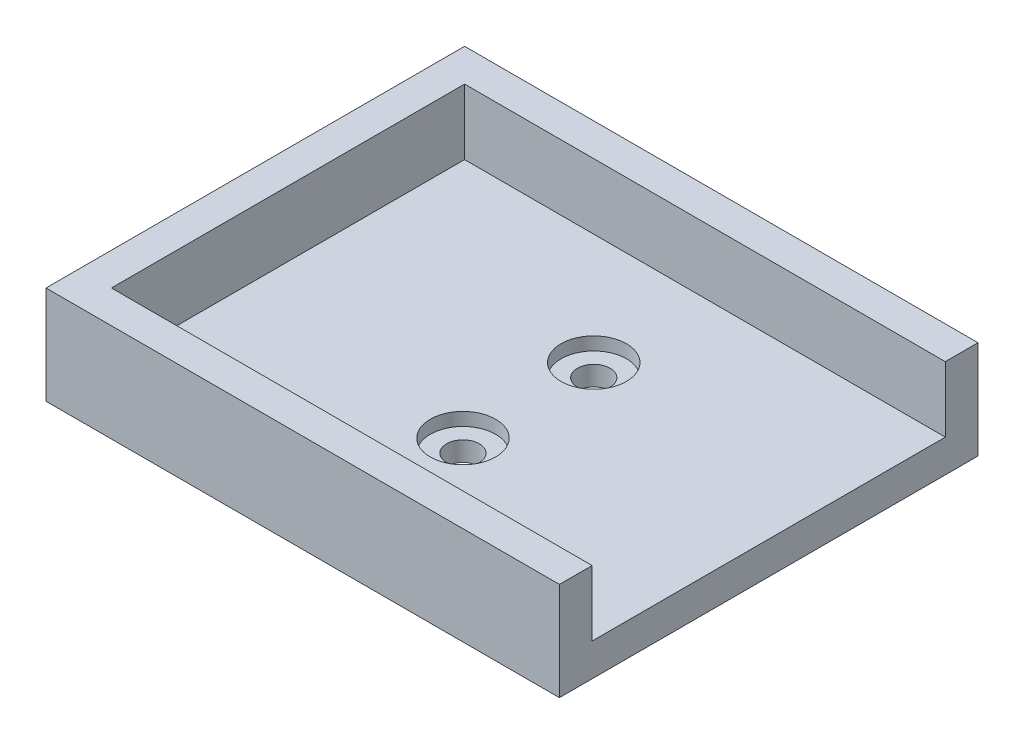
ISO-10303-21;
HEADER;
FILE_DESCRIPTION(('STEP AP214'),'2;1');
FILE_NAME('part.step','',(''),(''),'','','');
FILE_SCHEMA(('AUTOMOTIVE_DESIGN { 1 0 10303 214 1 1 1 1 }'));
ENDSEC;
DATA;
#1=APPLICATION_CONTEXT('core data for automotive mechanical design processes');
#2=APPLICATION_PROTOCOL_DEFINITION('international standard','automotive_design',2000,#1);
#3=PRODUCT_CONTEXT('',#1,'mechanical');
#4=PRODUCT('Part','Part','',(#3));
#5=PRODUCT_RELATED_PRODUCT_CATEGORY('part','',(#4));
#6=PRODUCT_DEFINITION_FORMATION('','',#4);
#7=PRODUCT_DEFINITION_CONTEXT('part definition',#1,'design');
#8=PRODUCT_DEFINITION('design','',#6,#7);
#9=PRODUCT_DEFINITION_SHAPE('','',#8);
#10=(LENGTH_UNIT() NAMED_UNIT(*) SI_UNIT(.MILLI.,.METRE.));
#11=(NAMED_UNIT(*) PLANE_ANGLE_UNIT() SI_UNIT($,.RADIAN.));
#12=(NAMED_UNIT(*) SI_UNIT($,.STERADIAN.) SOLID_ANGLE_UNIT());
#13=UNCERTAINTY_MEASURE_WITH_UNIT(LENGTH_MEASURE(1.E-05),#10,'distance_accuracy_value','');
#14=(GEOMETRIC_REPRESENTATION_CONTEXT(3) GLOBAL_UNCERTAINTY_ASSIGNED_CONTEXT((#13)) GLOBAL_UNIT_ASSIGNED_CONTEXT((#10,
#11,#12)) REPRESENTATION_CONTEXT('',''));
#15=CARTESIAN_POINT('',(0.,0.,0.));
#16=DIRECTION('',(0.,0.,1.));
#17=DIRECTION('',(1.,0.,0.));
#18=AXIS2_PLACEMENT_3D('',#15,#16,#17);
#19=CARTESIAN_POINT('',(36.75,5.,-27.));
#20=DIRECTION('',(-1.,0.,0.));
#21=DIRECTION('',(0.,0.,1.));
#22=AXIS2_PLACEMENT_3D('',#19,#20,#21);
#23=PLANE('',#22);
#24=DIRECTION('',(0.,0.,-1.));
#25=VECTOR('',#24,1.);
#26=CARTESIAN_POINT('',(36.75,0.,-27.));
#27=LINE('',#26,#25);
#28=CARTESIAN_POINT('',(36.75,0.,32.));
#29=VERTEX_POINT('',#28);
#30=CARTESIAN_POINT('',(36.75,0.,-32.));
#31=VERTEX_POINT('',#30);
#32=EDGE_CURVE('E65',#29,#31,#27,.T.);
#33=ORIENTED_EDGE('',*,*,#32,.T.);
#34=DIRECTION('',(0.,-1.,0.));
#35=VECTOR('',#34,1.);
#36=CARTESIAN_POINT('',(36.75,15.,-32.));
#37=LINE('',#36,#35);
#38=CARTESIAN_POINT('',(36.75,15.,-32.));
#39=VERTEX_POINT('',#38);
#40=EDGE_CURVE('E159',#39,#31,#37,.T.);
#41=ORIENTED_EDGE('',*,*,#40,.F.);
#42=DIRECTION('',(0.,0.,-1.));
#43=VECTOR('',#42,1.);
#44=CARTESIAN_POINT('',(36.75,15.,-27.));
#45=LINE('',#44,#43);
#46=CARTESIAN_POINT('',(36.75,15.,-27.));
#47=VERTEX_POINT('',#46);
#48=EDGE_CURVE('E139',#47,#39,#45,.T.);
#49=ORIENTED_EDGE('',*,*,#48,.F.);
#50=DIRECTION('',(0.,-1.,0.));
#51=VECTOR('',#50,1.);
#52=CARTESIAN_POINT('',(36.75,15.,-27.));
#53=LINE('',#52,#51);
#54=CARTESIAN_POINT('',(36.75,5.,-27.));
#55=VERTEX_POINT('',#54);
#56=EDGE_CURVE('E160',#47,#55,#53,.T.);
#57=ORIENTED_EDGE('',*,*,#56,.T.);
#58=DIRECTION('',(0.,0.,-1.));
#59=VECTOR('',#58,1.);
#60=CARTESIAN_POINT('',(36.75,5.,-27.));
#61=LINE('',#60,#59);
#62=CARTESIAN_POINT('',(36.75,5.,27.));
#63=VERTEX_POINT('',#62);
#64=EDGE_CURVE('E164',#63,#55,#61,.T.);
#65=ORIENTED_EDGE('',*,*,#64,.F.);
#66=DIRECTION('',(0.,-1.,0.));
#67=VECTOR('',#66,1.);
#68=CARTESIAN_POINT('',(36.75,15.,27.));
#69=LINE('',#68,#67);
#70=CARTESIAN_POINT('',(36.75,15.,27.));
#71=VERTEX_POINT('',#70);
#72=EDGE_CURVE('E187',#71,#63,#69,.T.);
#73=ORIENTED_EDGE('',*,*,#72,.F.);
#74=DIRECTION('',(0.,0.,1.));
#75=VECTOR('',#74,1.);
#76=CARTESIAN_POINT('',(36.75,15.,0.));
#77=LINE('',#76,#75);
#78=CARTESIAN_POINT('',(36.75,15.,32.));
#79=VERTEX_POINT('',#78);
#80=EDGE_CURVE('E189',#71,#79,#77,.T.);
#81=ORIENTED_EDGE('',*,*,#80,.T.);
#82=DIRECTION('',(0.,-1.,0.));
#83=VECTOR('',#82,1.);
#84=CARTESIAN_POINT('',(36.75,15.,32.));
#85=LINE('',#84,#83);
#86=EDGE_CURVE('E151',#79,#29,#85,.T.);
#87=ORIENTED_EDGE('',*,*,#86,.T.);
#88=EDGE_LOOP('',(#33,#41,#49,#57,#65,#73,#81,#87));
#89=FACE_BOUND('',#88,.T.);
#90=ADVANCED_FACE('F62',(#89),#23,.F.);
#91=CARTESIAN_POINT('',(0.,5.,0.));
#92=DIRECTION('',(0.,1.,0.));
#93=DIRECTION('',(0.,0.,1.));
#94=AXIS2_PLACEMENT_3D('',#91,#92,#93);
#95=PLANE('',#94);
#96=CARTESIAN_POINT('',(0.,5.,-10.));
#97=DIRECTION('',(0.,1.,0.));
#98=DIRECTION('',(0.,0.,1.));
#99=AXIS2_PLACEMENT_3D('',#96,#97,#98);
#100=CIRCLE('',#99,5.);
#101=CARTESIAN_POINT('',(0.,5.,-5.));
#102=VERTEX_POINT('',#101);
#103=EDGE_CURVE('E373',#102,#102,#100,.T.);
#104=ORIENTED_EDGE('',*,*,#103,.F.);
#105=EDGE_LOOP('',(#104));
#106=FACE_BOUND('',#105,.T.);
#107=CARTESIAN_POINT('',(0.,5.,10.));
#108=DIRECTION('',(0.,1.,0.));
#109=DIRECTION('',(0.,0.,1.));
#110=AXIS2_PLACEMENT_3D('',#107,#108,#109);
#111=CIRCLE('',#110,5.);
#112=CARTESIAN_POINT('',(0.,5.,15.));
#113=VERTEX_POINT('',#112);
#114=EDGE_CURVE('E370',#113,#113,#111,.T.);
#115=ORIENTED_EDGE('',*,*,#114,.F.);
#116=EDGE_LOOP('',(#115));
#117=FACE_BOUND('',#116,.T.);
#118=ORIENTED_EDGE('',*,*,#64,.T.);
#119=DIRECTION('',(-1.,0.,0.));
#120=VECTOR('',#119,1.);
#121=CARTESIAN_POINT('',(-36.75,5.,-27.));
#122=LINE('',#121,#120);
#123=CARTESIAN_POINT('',(-36.75,5.,-27.));
#124=VERTEX_POINT('',#123);
#125=EDGE_CURVE('E166',#55,#124,#122,.T.);
#126=ORIENTED_EDGE('',*,*,#125,.T.);
#127=DIRECTION('',(0.,0.,1.));
#128=VECTOR('',#127,1.);
#129=CARTESIAN_POINT('',(-36.75,5.,-27.));
#130=LINE('',#129,#128);
#131=CARTESIAN_POINT('',(-36.75,5.,27.));
#132=VERTEX_POINT('',#131);
#133=EDGE_CURVE('E70',#124,#132,#130,.T.);
#134=ORIENTED_EDGE('',*,*,#133,.T.);
#135=DIRECTION('',(1.,0.,0.));
#136=VECTOR('',#135,1.);
#137=CARTESIAN_POINT('',(-36.75,5.,27.));
#138=LINE('',#137,#136);
#139=EDGE_CURVE('E12',#132,#63,#138,.T.);
#140=ORIENTED_EDGE('',*,*,#139,.T.);
#141=EDGE_LOOP('',(#118,#126,#134,#140));
#142=FACE_BOUND('',#141,.T.);
#143=ADVANCED_FACE('F169',(#106,#117,#142),#95,.T.);
#144=CARTESIAN_POINT('',(0.,0.,0.));
#145=DIRECTION('',(0.,1.,0.));
#146=DIRECTION('',(0.,0.,1.));
#147=AXIS2_PLACEMENT_3D('',#144,#145,#146);
#148=PLANE('',#147);
#149=CARTESIAN_POINT('',(0.,0.,10.));
#150=DIRECTION('',(0.,1.,0.));
#151=DIRECTION('',(0.,0.,1.));
#152=AXIS2_PLACEMENT_3D('',#149,#150,#151);
#153=CIRCLE('',#152,2.5);
#154=CARTESIAN_POINT('',(0.,0.,12.5));
#155=VERTEX_POINT('',#154);
#156=EDGE_CURVE('E360',#155,#155,#153,.T.);
#157=ORIENTED_EDGE('',*,*,#156,.T.);
#158=EDGE_LOOP('',(#157));
#159=FACE_BOUND('',#158,.T.);
#160=CARTESIAN_POINT('',(0.,0.,-10.));
#161=DIRECTION('',(0.,1.,0.));
#162=DIRECTION('',(0.,0.,1.));
#163=AXIS2_PLACEMENT_3D('',#160,#161,#162);
#164=CIRCLE('',#163,2.5);
#165=CARTESIAN_POINT('',(0.,0.,-7.5));
#166=VERTEX_POINT('',#165);
#167=EDGE_CURVE('E367',#166,#166,#164,.T.);
#168=ORIENTED_EDGE('',*,*,#167,.T.);
#169=EDGE_LOOP('',(#168));
#170=FACE_BOUND('',#169,.T.);
#171=ORIENTED_EDGE('',*,*,#32,.F.);
#172=DIRECTION('',(-1.,0.,0.));
#173=VECTOR('',#172,1.);
#174=CARTESIAN_POINT('',(0.,0.,32.));
#175=LINE('',#174,#173);
#176=CARTESIAN_POINT('',(-41.75,0.,32.));
#177=VERTEX_POINT('',#176);
#178=EDGE_CURVE('E143',#29,#177,#175,.T.);
#179=ORIENTED_EDGE('',*,*,#178,.T.);
#180=DIRECTION('',(0.,0.,1.));
#181=VECTOR('',#180,1.);
#182=CARTESIAN_POINT('',(-41.75,0.,0.));
#183=LINE('',#182,#181);
#184=CARTESIAN_POINT('',(-41.75,0.,-32.));
#185=VERTEX_POINT('',#184);
#186=EDGE_CURVE('E194',#185,#177,#183,.T.);
#187=ORIENTED_EDGE('',*,*,#186,.F.);
#188=DIRECTION('',(-1.,0.,0.));
#189=VECTOR('',#188,1.);
#190=CARTESIAN_POINT('',(0.,0.,-32.));
#191=LINE('',#190,#189);
#192=EDGE_CURVE('E147',#31,#185,#191,.T.);
#193=ORIENTED_EDGE('',*,*,#192,.F.);
#194=EDGE_LOOP('',(#171,#179,#187,#193));
#195=FACE_BOUND('',#194,.T.);
#196=ADVANCED_FACE('F206',(#159,#170,#195),#148,.F.);
#197=CARTESIAN_POINT('',(-41.75,15.,0.));
#198=DIRECTION('',(1.,0.,0.));
#199=DIRECTION('',(0.,0.,-1.));
#200=AXIS2_PLACEMENT_3D('',#197,#198,#199);
#201=PLANE('',#200);
#202=ORIENTED_EDGE('',*,*,#186,.T.);
#203=DIRECTION('',(0.,-1.,0.));
#204=VECTOR('',#203,1.);
#205=CARTESIAN_POINT('',(-41.75,15.,32.));
#206=LINE('',#205,#204);
#207=CARTESIAN_POINT('',(-41.75,15.,32.));
#208=VERTEX_POINT('',#207);
#209=EDGE_CURVE('E129',#208,#177,#206,.T.);
#210=ORIENTED_EDGE('',*,*,#209,.F.);
#211=DIRECTION('',(0.,0.,1.));
#212=VECTOR('',#211,1.);
#213=CARTESIAN_POINT('',(-41.75,15.,0.));
#214=LINE('',#213,#212);
#215=CARTESIAN_POINT('',(-41.75,15.,-32.));
#216=VERTEX_POINT('',#215);
#217=EDGE_CURVE('E122',#216,#208,#214,.T.);
#218=ORIENTED_EDGE('',*,*,#217,.F.);
#219=DIRECTION('',(0.,-1.,0.));
#220=VECTOR('',#219,1.);
#221=CARTESIAN_POINT('',(-41.75,15.,-32.));
#222=LINE('',#221,#220);
#223=EDGE_CURVE('E127',#216,#185,#222,.T.);
#224=ORIENTED_EDGE('',*,*,#223,.T.);
#225=EDGE_LOOP('',(#202,#210,#218,#224));
#226=FACE_BOUND('',#225,.T.);
#227=ADVANCED_FACE('F125',(#226),#201,.F.);
#228=CARTESIAN_POINT('',(0.,15.,32.));
#229=DIRECTION('',(0.,0.,1.));
#230=DIRECTION('',(1.,0.,0.));
#231=AXIS2_PLACEMENT_3D('',#228,#229,#230);
#232=PLANE('',#231);
#233=ORIENTED_EDGE('',*,*,#178,.F.);
#234=ORIENTED_EDGE('',*,*,#86,.F.);
#235=DIRECTION('',(-1.,0.,0.));
#236=VECTOR('',#235,1.);
#237=CARTESIAN_POINT('',(0.,15.,32.));
#238=LINE('',#237,#236);
#239=EDGE_CURVE('E133',#79,#208,#238,.T.);
#240=ORIENTED_EDGE('',*,*,#239,.T.);
#241=ORIENTED_EDGE('',*,*,#209,.T.);
#242=EDGE_LOOP('',(#233,#234,#240,#241));
#243=FACE_BOUND('',#242,.T.);
#244=ADVANCED_FACE('F204',(#243),#232,.T.);
#245=CARTESIAN_POINT('',(0.,15.,27.));
#246=DIRECTION('',(0.,0.,-1.));
#247=DIRECTION('',(-1.,0.,0.));
#248=AXIS2_PLACEMENT_3D('',#245,#246,#247);
#249=PLANE('',#248);
#250=ORIENTED_EDGE('',*,*,#72,.T.);
#251=ORIENTED_EDGE('',*,*,#139,.F.);
#252=DIRECTION('',(0.,-1.,0.));
#253=VECTOR('',#252,1.);
#254=CARTESIAN_POINT('',(-36.75,15.,27.));
#255=LINE('',#254,#253);
#256=CARTESIAN_POINT('',(-36.75,15.,27.));
#257=VERTEX_POINT('',#256);
#258=EDGE_CURVE('E178',#257,#132,#255,.T.);
#259=ORIENTED_EDGE('',*,*,#258,.F.);
#260=DIRECTION('',(1.,0.,0.));
#261=VECTOR('',#260,1.);
#262=CARTESIAN_POINT('',(0.,15.,27.));
#263=LINE('',#262,#261);
#264=EDGE_CURVE('E185',#257,#71,#263,.T.);
#265=ORIENTED_EDGE('',*,*,#264,.T.);
#266=EDGE_LOOP('',(#250,#251,#259,#265));
#267=FACE_BOUND('',#266,.T.);
#268=ADVANCED_FACE('F208',(#267),#249,.T.);
#269=CARTESIAN_POINT('',(-36.75,15.,0.));
#270=DIRECTION('',(1.,0.,0.));
#271=DIRECTION('',(0.,0.,-1.));
#272=AXIS2_PLACEMENT_3D('',#269,#270,#271);
#273=PLANE('',#272);
#274=ORIENTED_EDGE('',*,*,#258,.T.);
#275=ORIENTED_EDGE('',*,*,#133,.F.);
#276=DIRECTION('',(0.,1.,0.));
#277=VECTOR('',#276,1.);
#278=CARTESIAN_POINT('',(-36.75,15.,-27.));
#279=LINE('',#278,#277);
#280=CARTESIAN_POINT('',(-36.75,15.,-27.));
#281=VERTEX_POINT('',#280);
#282=EDGE_CURVE('E148',#124,#281,#279,.T.);
#283=ORIENTED_EDGE('',*,*,#282,.T.);
#284=DIRECTION('',(0.,0.,1.));
#285=VECTOR('',#284,1.);
#286=CARTESIAN_POINT('',(-36.75,15.,0.));
#287=LINE('',#286,#285);
#288=EDGE_CURVE('E182',#281,#257,#287,.T.);
#289=ORIENTED_EDGE('',*,*,#288,.T.);
#290=EDGE_LOOP('',(#274,#275,#283,#289));
#291=FACE_BOUND('',#290,.T.);
#292=ADVANCED_FACE('F175',(#291),#273,.T.);
#293=CARTESIAN_POINT('',(0.,15.,-32.));
#294=DIRECTION('',(0.,0.,1.));
#295=DIRECTION('',(1.,0.,0.));
#296=AXIS2_PLACEMENT_3D('',#293,#294,#295);
#297=PLANE('',#296);
#298=ORIENTED_EDGE('',*,*,#192,.T.);
#299=ORIENTED_EDGE('',*,*,#223,.F.);
#300=DIRECTION('',(-1.,0.,0.));
#301=VECTOR('',#300,1.);
#302=CARTESIAN_POINT('',(0.,15.,-32.));
#303=LINE('',#302,#301);
#304=EDGE_CURVE('E134',#39,#216,#303,.T.);
#305=ORIENTED_EDGE('',*,*,#304,.F.);
#306=ORIENTED_EDGE('',*,*,#40,.T.);
#307=EDGE_LOOP('',(#298,#299,#305,#306));
#308=FACE_BOUND('',#307,.T.);
#309=ADVANCED_FACE('F145',(#308),#297,.F.);
#310=CARTESIAN_POINT('',(0.,15.,0.));
#311=DIRECTION('',(0.,1.,0.));
#312=DIRECTION('',(0.,0.,1.));
#313=AXIS2_PLACEMENT_3D('',#310,#311,#312);
#314=PLANE('',#313);
#315=ORIENTED_EDGE('',*,*,#304,.T.);
#316=ORIENTED_EDGE('',*,*,#217,.T.);
#317=ORIENTED_EDGE('',*,*,#239,.F.);
#318=ORIENTED_EDGE('',*,*,#80,.F.);
#319=ORIENTED_EDGE('',*,*,#264,.F.);
#320=ORIENTED_EDGE('',*,*,#288,.F.);
#321=DIRECTION('',(1.,0.,0.));
#322=VECTOR('',#321,1.);
#323=CARTESIAN_POINT('',(-36.75,15.,-27.));
#324=LINE('',#323,#322);
#325=EDGE_CURVE('E156',#281,#47,#324,.T.);
#326=ORIENTED_EDGE('',*,*,#325,.T.);
#327=ORIENTED_EDGE('',*,*,#48,.T.);
#328=EDGE_LOOP('',(#315,#316,#317,#318,#319,#320,#326,#327));
#329=FACE_BOUND('',#328,.T.);
#330=ADVANCED_FACE('F137',(#329),#314,.T.);
#331=CARTESIAN_POINT('',(-36.75,15.,-27.));
#332=DIRECTION('',(0.,0.,-1.));
#333=DIRECTION('',(-1.,0.,0.));
#334=AXIS2_PLACEMENT_3D('',#331,#332,#333);
#335=PLANE('',#334);
#336=ORIENTED_EDGE('',*,*,#125,.F.);
#337=ORIENTED_EDGE('',*,*,#56,.F.);
#338=ORIENTED_EDGE('',*,*,#325,.F.);
#339=ORIENTED_EDGE('',*,*,#282,.F.);
#340=EDGE_LOOP('',(#336,#337,#338,#339));
#341=FACE_BOUND('',#340,.T.);
#342=ADVANCED_FACE('F179',(#341),#335,.F.);
#343=CARTESIAN_POINT('',(0.,3.,10.));
#344=DIRECTION('',(0.,1.,0.));
#345=DIRECTION('',(0.,0.,1.));
#346=AXIS2_PLACEMENT_3D('',#343,#344,#345);
#347=CYLINDRICAL_SURFACE('',#346,5.);
#348=CARTESIAN_POINT('',(0.,3.,10.));
#349=DIRECTION('',(0.,1.,0.));
#350=DIRECTION('',(0.,0.,1.));
#351=AXIS2_PLACEMENT_3D('',#348,#349,#350);
#352=CIRCLE('',#351,5.);
#353=CARTESIAN_POINT('',(0.,3.,15.));
#354=VERTEX_POINT('',#353);
#355=EDGE_CURVE('E376',#354,#354,#352,.T.);
#356=ORIENTED_EDGE('',*,*,#355,.F.);
#357=EDGE_LOOP('',(#356));
#358=FACE_BOUND('',#357,.T.);
#359=ORIENTED_EDGE('',*,*,#114,.T.);
#360=EDGE_LOOP('',(#359));
#361=FACE_BOUND('',#360,.T.);
#362=ADVANCED_FACE('F232',(#358,#361),#347,.F.);
#363=CARTESIAN_POINT('',(0.,3.,10.));
#364=DIRECTION('',(0.,1.,0.));
#365=DIRECTION('',(0.,0.,1.));
#366=AXIS2_PLACEMENT_3D('',#363,#364,#365);
#367=PLANE('',#366);
#368=CARTESIAN_POINT('',(0.,3.,10.));
#369=DIRECTION('',(0.,1.,0.));
#370=DIRECTION('',(0.,0.,1.));
#371=AXIS2_PLACEMENT_3D('',#368,#369,#370);
#372=CIRCLE('',#371,2.5);
#373=CARTESIAN_POINT('',(0.,3.,12.5));
#374=VERTEX_POINT('',#373);
#375=EDGE_CURVE('E357',#374,#374,#372,.F.);
#376=ORIENTED_EDGE('',*,*,#375,.T.);
#377=EDGE_LOOP('',(#376));
#378=FACE_BOUND('',#377,.T.);
#379=ORIENTED_EDGE('',*,*,#355,.T.);
#380=EDGE_LOOP('',(#379));
#381=FACE_BOUND('',#380,.T.);
#382=ADVANCED_FACE('F295',(#378,#381),#367,.T.);
#383=CARTESIAN_POINT('',(0.,3.,-10.));
#384=DIRECTION('',(0.,1.,0.));
#385=DIRECTION('',(0.,0.,1.));
#386=AXIS2_PLACEMENT_3D('',#383,#384,#385);
#387=CYLINDRICAL_SURFACE('',#386,5.);
#388=CARTESIAN_POINT('',(0.,3.,-10.));
#389=DIRECTION('',(0.,1.,0.));
#390=DIRECTION('',(0.,0.,1.));
#391=AXIS2_PLACEMENT_3D('',#388,#389,#390);
#392=CIRCLE('',#391,5.);
#393=CARTESIAN_POINT('',(0.,3.,-5.));
#394=VERTEX_POINT('',#393);
#395=EDGE_CURVE('E157',#394,#394,#392,.T.);
#396=ORIENTED_EDGE('',*,*,#395,.F.);
#397=EDGE_LOOP('',(#396));
#398=FACE_BOUND('',#397,.T.);
#399=ORIENTED_EDGE('',*,*,#103,.T.);
#400=EDGE_LOOP('',(#399));
#401=FACE_BOUND('',#400,.T.);
#402=ADVANCED_FACE('F305',(#398,#401),#387,.F.);
#403=CARTESIAN_POINT('',(0.,3.,-10.));
#404=DIRECTION('',(0.,1.,0.));
#405=DIRECTION('',(0.,0.,1.));
#406=AXIS2_PLACEMENT_3D('',#403,#404,#405);
#407=PLANE('',#406);
#408=CARTESIAN_POINT('',(0.,3.,-10.));
#409=DIRECTION('',(0.,1.,0.));
#410=DIRECTION('',(0.,0.,1.));
#411=AXIS2_PLACEMENT_3D('',#408,#409,#410);
#412=CIRCLE('',#411,2.5);
#413=CARTESIAN_POINT('',(0.,3.,-7.5));
#414=VERTEX_POINT('',#413);
#415=EDGE_CURVE('E362',#414,#414,#412,.T.);
#416=ORIENTED_EDGE('',*,*,#415,.F.);
#417=EDGE_LOOP('',(#416));
#418=FACE_BOUND('',#417,.T.);
#419=ORIENTED_EDGE('',*,*,#395,.T.);
#420=EDGE_LOOP('',(#419));
#421=FACE_BOUND('',#420,.T.);
#422=ADVANCED_FACE('F315',(#418,#421),#407,.T.);
#423=CARTESIAN_POINT('',(0.,-1.2E-05,-10.));
#424=DIRECTION('',(0.,1.,0.));
#425=DIRECTION('',(0.,0.,1.));
#426=AXIS2_PLACEMENT_3D('',#423,#424,#425);
#427=CYLINDRICAL_SURFACE('',#426,2.5);
#428=ORIENTED_EDGE('',*,*,#415,.T.);
#429=EDGE_LOOP('',(#428));
#430=FACE_BOUND('',#429,.T.);
#431=ORIENTED_EDGE('',*,*,#167,.F.);
#432=EDGE_LOOP('',(#431));
#433=FACE_BOUND('',#432,.T.);
#434=ADVANCED_FACE('F325',(#430,#433),#427,.F.);
#435=CARTESIAN_POINT('',(0.,10.,10.));
#436=DIRECTION('',(0.,-1.,0.));
#437=DIRECTION('',(0.,0.,-1.));
#438=AXIS2_PLACEMENT_3D('',#435,#436,#437);
#439=CYLINDRICAL_SURFACE('',#438,2.5);
#440=ORIENTED_EDGE('',*,*,#375,.F.);
#441=EDGE_LOOP('',(#440));
#442=FACE_BOUND('',#441,.T.);
#443=ORIENTED_EDGE('',*,*,#156,.F.);
#444=EDGE_LOOP('',(#443));
#445=FACE_BOUND('',#444,.T.);
#446=ADVANCED_FACE('F334',(#442,#445),#439,.F.);
#447=CLOSED_SHELL('',(#90,#143,#196,#227,#244,#268,#292,#309,#330,#342,#362,#382,#402,#422,#434,#446));
#448=MANIFOLD_SOLID_BREP('B2',#447);
#449=ADVANCED_BREP_SHAPE_REPRESENTATION('',(#18,#448),#14);
#450=SHAPE_DEFINITION_REPRESENTATION(#9,#449);
ENDSEC;
END-ISO-10303-21;
